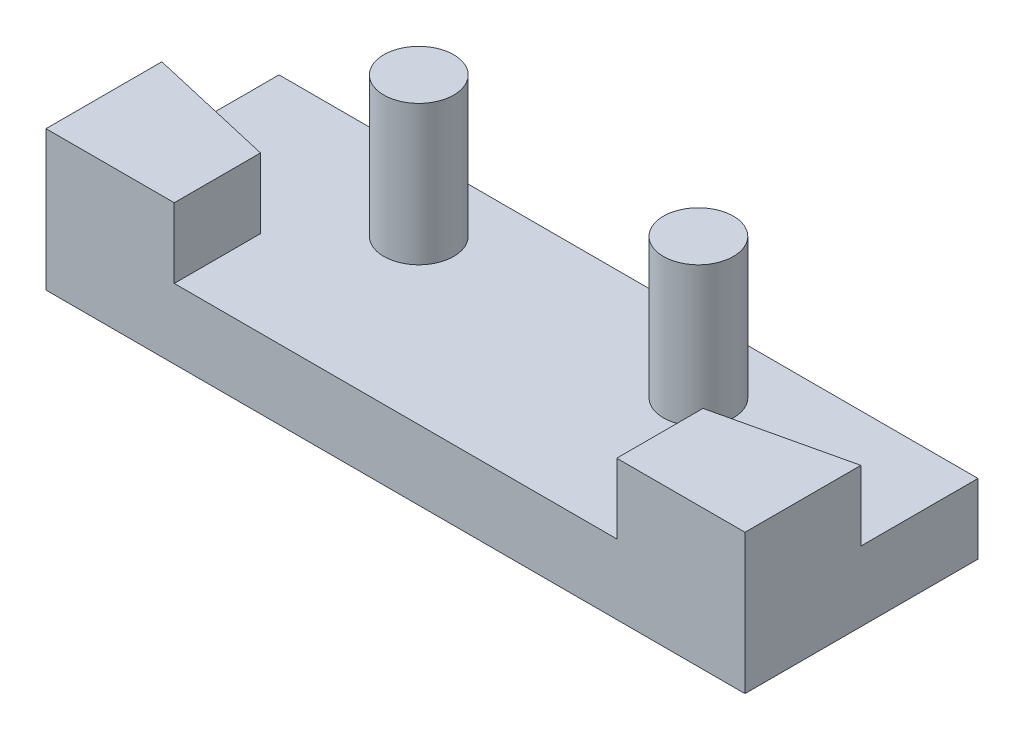
ISO-10303-21;
HEADER;
FILE_DESCRIPTION(('STEP AP214'),'2;1');
FILE_NAME('part.step','',(''),(''),'','','');
FILE_SCHEMA(('AUTOMOTIVE_DESIGN { 1 0 10303 214 1 1 1 1 }'));
ENDSEC;
DATA;
#1=APPLICATION_CONTEXT('core data for automotive mechanical design processes');
#2=APPLICATION_PROTOCOL_DEFINITION('international standard','automotive_design',2000,#1);
#3=PRODUCT_CONTEXT('',#1,'mechanical');
#4=PRODUCT('Part','Part','',(#3));
#5=PRODUCT_RELATED_PRODUCT_CATEGORY('part','',(#4));
#6=PRODUCT_DEFINITION_FORMATION('','',#4);
#7=PRODUCT_DEFINITION_CONTEXT('part definition',#1,'design');
#8=PRODUCT_DEFINITION('design','',#6,#7);
#9=PRODUCT_DEFINITION_SHAPE('','',#8);
#10=(LENGTH_UNIT() NAMED_UNIT(*) SI_UNIT(.MILLI.,.METRE.));
#11=(NAMED_UNIT(*) PLANE_ANGLE_UNIT() SI_UNIT($,.RADIAN.));
#12=(NAMED_UNIT(*) SI_UNIT($,.STERADIAN.) SOLID_ANGLE_UNIT());
#13=UNCERTAINTY_MEASURE_WITH_UNIT(LENGTH_MEASURE(1.E-05),#10,'distance_accuracy_value','');
#14=(GEOMETRIC_REPRESENTATION_CONTEXT(3) GLOBAL_UNCERTAINTY_ASSIGNED_CONTEXT((#13)) GLOBAL_UNIT_ASSIGNED_CONTEXT((#10,
#11,#12)) REPRESENTATION_CONTEXT('',''));
#15=CARTESIAN_POINT('',(0.,0.,0.));
#16=DIRECTION('',(0.,0.,1.));
#17=DIRECTION('',(1.,0.,0.));
#18=AXIS2_PLACEMENT_3D('',#15,#16,#17);
#19=CARTESIAN_POINT('',(0.,6.,10.));
#20=DIRECTION('',(0.,0.,-1.));
#21=DIRECTION('',(-1.,0.,0.));
#22=AXIS2_PLACEMENT_3D('',#19,#20,#21);
#23=PLANE('',#22);
#24=DIRECTION('',(0.,1.,0.));
#25=VECTOR('',#24,1.);
#26=CARTESIAN_POINT('',(24.4957241447966,3.,10.));
#27=LINE('',#26,#25);
#28=CARTESIAN_POINT('',(24.4957241447966,3.,10.));
#29=VERTEX_POINT('',#28);
#30=CARTESIAN_POINT('',(24.4957241447966,6.,10.));
#31=VERTEX_POINT('',#30);
#32=EDGE_CURVE('E200',#29,#31,#27,.T.);
#33=ORIENTED_EDGE('',*,*,#32,.F.);
#34=DIRECTION('',(1.,0.,0.));
#35=VECTOR('',#34,1.);
#36=CARTESIAN_POINT('',(5.50427585520336,3.,10.));
#37=LINE('',#36,#35);
#38=CARTESIAN_POINT('',(5.50427585520336,3.,10.));
#39=VERTEX_POINT('',#38);
#40=EDGE_CURVE('E186',#39,#29,#37,.T.);
#41=ORIENTED_EDGE('',*,*,#40,.F.);
#42=DIRECTION('',(0.,1.,0.));
#43=VECTOR('',#42,1.);
#44=CARTESIAN_POINT('',(5.50427585520336,3.,10.));
#45=LINE('',#44,#43);
#46=CARTESIAN_POINT('',(5.50427585520336,6.,10.));
#47=VERTEX_POINT('',#46);
#48=EDGE_CURVE('E198',#39,#47,#45,.T.);
#49=ORIENTED_EDGE('',*,*,#48,.T.);
#50=DIRECTION('',(1.,0.,0.));
#51=VECTOR('',#50,1.);
#52=CARTESIAN_POINT('',(0.,6.,10.));
#53=LINE('',#52,#51);
#54=CARTESIAN_POINT('',(0.,6.,10.));
#55=VERTEX_POINT('',#54);
#56=EDGE_CURVE('E128',#55,#47,#53,.T.);
#57=ORIENTED_EDGE('',*,*,#56,.F.);
#58=DIRECTION('',(0.,-1.,0.));
#59=VECTOR('',#58,1.);
#60=CARTESIAN_POINT('',(0.,6.,10.));
#61=LINE('',#60,#59);
#62=CARTESIAN_POINT('',(0.,0.,10.));
#63=VERTEX_POINT('',#62);
#64=EDGE_CURVE('E11',#55,#63,#61,.T.);
#65=ORIENTED_EDGE('',*,*,#64,.T.);
#66=DIRECTION('',(1.,0.,0.));
#67=VECTOR('',#66,1.);
#68=CARTESIAN_POINT('',(0.,0.,10.));
#69=LINE('',#68,#67);
#70=CARTESIAN_POINT('',(30.,0.,10.));
#71=VERTEX_POINT('',#70);
#72=EDGE_CURVE('E107',#63,#71,#69,.T.);
#73=ORIENTED_EDGE('',*,*,#72,.T.);
#74=DIRECTION('',(0.,-1.,0.));
#75=VECTOR('',#74,1.);
#76=CARTESIAN_POINT('',(30.,6.,10.));
#77=LINE('',#76,#75);
#78=CARTESIAN_POINT('',(30.,6.,10.));
#79=VERTEX_POINT('',#78);
#80=EDGE_CURVE('E45',#79,#71,#77,.T.);
#81=ORIENTED_EDGE('',*,*,#80,.F.);
#82=EDGE_CURVE('E61',#31,#79,#53,.T.);
#83=ORIENTED_EDGE('',*,*,#82,.F.);
#84=EDGE_LOOP('',(#33,#41,#49,#57,#65,#73,#81,#83));
#85=FACE_BOUND('',#84,.T.);
#86=ADVANCED_FACE('F37',(#85),#23,.F.);
#87=CARTESIAN_POINT('',(30.,6.,0.));
#88=DIRECTION('',(-1.,0.,0.));
#89=DIRECTION('',(0.,0.,1.));
#90=AXIS2_PLACEMENT_3D('',#87,#88,#89);
#91=PLANE('',#90);
#92=DIRECTION('',(0.,1.,0.));
#93=VECTOR('',#92,1.);
#94=CARTESIAN_POINT('',(30.,3.,5.02740271104353));
#95=LINE('',#94,#93);
#96=CARTESIAN_POINT('',(30.,3.,5.02740271104353));
#97=VERTEX_POINT('',#96);
#98=CARTESIAN_POINT('',(30.,6.,5.02740271104353));
#99=VERTEX_POINT('',#98);
#100=EDGE_CURVE('E108',#97,#99,#95,.T.);
#101=ORIENTED_EDGE('',*,*,#100,.T.);
#102=DIRECTION('',(0.,0.,-1.));
#103=VECTOR('',#102,1.);
#104=CARTESIAN_POINT('',(30.,6.,0.));
#105=LINE('',#104,#103);
#106=EDGE_CURVE('E94',#79,#99,#105,.T.);
#107=ORIENTED_EDGE('',*,*,#106,.F.);
#108=ORIENTED_EDGE('',*,*,#80,.T.);
#109=DIRECTION('',(0.,0.,-1.));
#110=VECTOR('',#109,1.);
#111=CARTESIAN_POINT('',(30.,0.,0.));
#112=LINE('',#111,#110);
#113=CARTESIAN_POINT('',(30.,0.,0.));
#114=VERTEX_POINT('',#113);
#115=EDGE_CURVE('E104',#71,#114,#112,.T.);
#116=ORIENTED_EDGE('',*,*,#115,.T.);
#117=DIRECTION('',(0.,-1.,0.));
#118=VECTOR('',#117,1.);
#119=CARTESIAN_POINT('',(30.,6.,0.));
#120=LINE('',#119,#118);
#121=CARTESIAN_POINT('',(30.,3.,0.));
#122=VERTEX_POINT('',#121);
#123=EDGE_CURVE('E93',#122,#114,#120,.T.);
#124=ORIENTED_EDGE('',*,*,#123,.F.);
#125=DIRECTION('',(0.,0.,-1.));
#126=VECTOR('',#125,1.);
#127=CARTESIAN_POINT('',(30.,3.,5.02740271104353));
#128=LINE('',#127,#126);
#129=EDGE_CURVE('E215',#97,#122,#128,.T.);
#130=ORIENTED_EDGE('',*,*,#129,.F.);
#131=EDGE_LOOP('',(#101,#107,#108,#116,#124,#130));
#132=FACE_BOUND('',#131,.T.);
#133=ADVANCED_FACE('F121',(#132),#91,.F.);
#134=CARTESIAN_POINT('',(0.,6.,0.));
#135=DIRECTION('',(0.,1.,0.));
#136=DIRECTION('',(0.,0.,1.));
#137=AXIS2_PLACEMENT_3D('',#134,#135,#136);
#138=PLANE('',#137);
#139=ORIENTED_EDGE('',*,*,#106,.T.);
#140=DIRECTION('',(-0.974370064785236,0.,0.224951054343862));
#141=VECTOR('',#140,1.);
#142=CARTESIAN_POINT('',(30.,6.,5.02740271104353));
#143=LINE('',#142,#141);
#144=CARTESIAN_POINT('',(24.4957241447966,6.,6.29816492119042));
#145=VERTEX_POINT('',#144);
#146=EDGE_CURVE('E139',#99,#145,#143,.T.);
#147=ORIENTED_EDGE('',*,*,#146,.T.);
#148=DIRECTION('',(0.,0.,1.));
#149=VECTOR('',#148,1.);
#150=CARTESIAN_POINT('',(24.4957241447966,6.,6.29816492119042));
#151=LINE('',#150,#149);
#152=EDGE_CURVE('E191',#145,#31,#151,.T.);
#153=ORIENTED_EDGE('',*,*,#152,.T.);
#154=ORIENTED_EDGE('',*,*,#82,.T.);
#155=EDGE_LOOP('',(#139,#147,#153,#154));
#156=FACE_BOUND('',#155,.T.);
#157=ADVANCED_FACE('F136',(#156),#138,.T.);
#158=CARTESIAN_POINT('',(0.,6.,0.));
#159=DIRECTION('',(1.,0.,0.));
#160=DIRECTION('',(0.,0.,-1.));
#161=AXIS2_PLACEMENT_3D('',#158,#159,#160);
#162=PLANE('',#161);
#163=DIRECTION('',(0.,0.,1.));
#164=VECTOR('',#163,1.);
#165=CARTESIAN_POINT('',(0.,6.,0.));
#166=LINE('',#165,#164);
#167=CARTESIAN_POINT('',(0.,6.,5.02740271104353));
#168=VERTEX_POINT('',#167);
#169=EDGE_CURVE('E103',#168,#55,#166,.T.);
#170=ORIENTED_EDGE('',*,*,#169,.F.);
#171=DIRECTION('',(0.,1.,0.));
#172=VECTOR('',#171,1.);
#173=CARTESIAN_POINT('',(0.,3.,5.02740271104353));
#174=LINE('',#173,#172);
#175=CARTESIAN_POINT('',(0.,3.,5.02740271104353));
#176=VERTEX_POINT('',#175);
#177=EDGE_CURVE('E52',#176,#168,#174,.T.);
#178=ORIENTED_EDGE('',*,*,#177,.F.);
#179=DIRECTION('',(0.,0.,-1.));
#180=VECTOR('',#179,1.);
#181=CARTESIAN_POINT('',(0.,3.,5.02740271104353));
#182=LINE('',#181,#180);
#183=CARTESIAN_POINT('',(0.,3.,0.));
#184=VERTEX_POINT('',#183);
#185=EDGE_CURVE('E90',#176,#184,#182,.T.);
#186=ORIENTED_EDGE('',*,*,#185,.T.);
#187=DIRECTION('',(0.,-1.,0.));
#188=VECTOR('',#187,1.);
#189=CARTESIAN_POINT('',(0.,6.,0.));
#190=LINE('',#189,#188);
#191=CARTESIAN_POINT('',(0.,0.,0.));
#192=VERTEX_POINT('',#191);
#193=EDGE_CURVE('E82',#184,#192,#190,.T.);
#194=ORIENTED_EDGE('',*,*,#193,.T.);
#195=DIRECTION('',(0.,0.,1.));
#196=VECTOR('',#195,1.);
#197=CARTESIAN_POINT('',(0.,0.,0.));
#198=LINE('',#197,#196);
#199=EDGE_CURVE('E87',#192,#63,#198,.T.);
#200=ORIENTED_EDGE('',*,*,#199,.T.);
#201=ORIENTED_EDGE('',*,*,#64,.F.);
#202=EDGE_LOOP('',(#170,#178,#186,#194,#200,#201));
#203=FACE_BOUND('',#202,.T.);
#204=ADVANCED_FACE('F39',(#203),#162,.F.);
#205=CARTESIAN_POINT('',(0.,6.,0.));
#206=DIRECTION('',(0.,0.,1.));
#207=DIRECTION('',(1.,0.,0.));
#208=AXIS2_PLACEMENT_3D('',#205,#206,#207);
#209=PLANE('',#208);
#210=ORIENTED_EDGE('',*,*,#193,.F.);
#211=DIRECTION('',(1.,0.,0.));
#212=VECTOR('',#211,1.);
#213=CARTESIAN_POINT('',(0.,3.,0.));
#214=LINE('',#213,#212);
#215=EDGE_CURVE('E162',#184,#122,#214,.T.);
#216=ORIENTED_EDGE('',*,*,#215,.T.);
#217=ORIENTED_EDGE('',*,*,#123,.T.);
#218=DIRECTION('',(-1.,0.,0.));
#219=VECTOR('',#218,1.);
#220=CARTESIAN_POINT('',(0.,0.,0.));
#221=LINE('',#220,#219);
#222=EDGE_CURVE('E97',#114,#192,#221,.T.);
#223=ORIENTED_EDGE('',*,*,#222,.T.);
#224=EDGE_LOOP('',(#210,#216,#217,#223));
#225=FACE_BOUND('',#224,.T.);
#226=ADVANCED_FACE('F98',(#225),#209,.F.);
#227=DIRECTION('',(0.,0.,1.));
#228=VECTOR('',#227,1.);
#229=CARTESIAN_POINT('',(5.50427585520336,6.,6.29816492119042));
#230=LINE('',#229,#228);
#231=CARTESIAN_POINT('',(5.50427585520336,6.,6.29816492119042));
#232=VERTEX_POINT('',#231);
#233=EDGE_CURVE('E194',#232,#47,#230,.T.);
#234=ORIENTED_EDGE('',*,*,#233,.F.);
#235=DIRECTION('',(0.974370064785236,0.,0.224951054343862));
#236=VECTOR('',#235,1.);
#237=CARTESIAN_POINT('',(0.,6.,5.02740271104353));
#238=LINE('',#237,#236);
#239=EDGE_CURVE('E180',#168,#232,#238,.T.);
#240=ORIENTED_EDGE('',*,*,#239,.F.);
#241=ORIENTED_EDGE('',*,*,#169,.T.);
#242=ORIENTED_EDGE('',*,*,#56,.T.);
#243=EDGE_LOOP('',(#234,#240,#241,#242));
#244=FACE_BOUND('',#243,.T.);
#245=ADVANCED_FACE('F253',(#244),#138,.T.);
#246=CARTESIAN_POINT('',(0.,0.,0.));
#247=DIRECTION('',(0.,1.,0.));
#248=DIRECTION('',(0.,0.,1.));
#249=AXIS2_PLACEMENT_3D('',#246,#247,#248);
#250=PLANE('',#249);
#251=ORIENTED_EDGE('',*,*,#199,.F.);
#252=ORIENTED_EDGE('',*,*,#222,.F.);
#253=ORIENTED_EDGE('',*,*,#115,.F.);
#254=ORIENTED_EDGE('',*,*,#72,.F.);
#255=EDGE_LOOP('',(#251,#252,#253,#254));
#256=FACE_BOUND('',#255,.T.);
#257=ADVANCED_FACE('F106',(#256),#250,.F.);
#258=CARTESIAN_POINT('',(30.,3.,5.02740271104353));
#259=DIRECTION('',(-0.224951054343862,0.,-0.974370064785236));
#260=DIRECTION('',(-0.974370064785236,0.,0.224951054343862));
#261=AXIS2_PLACEMENT_3D('',#258,#259,#260);
#262=PLANE('',#261);
#263=ORIENTED_EDGE('',*,*,#146,.F.);
#264=ORIENTED_EDGE('',*,*,#100,.F.);
#265=DIRECTION('',(-0.974370064785236,0.,0.224951054343862));
#266=VECTOR('',#265,1.);
#267=CARTESIAN_POINT('',(30.,3.,5.02740271104353));
#268=LINE('',#267,#266);
#269=CARTESIAN_POINT('',(24.4957241447966,3.,6.29816492119042));
#270=VERTEX_POINT('',#269);
#271=EDGE_CURVE('E205',#97,#270,#268,.T.);
#272=ORIENTED_EDGE('',*,*,#271,.T.);
#273=DIRECTION('',(0.,1.,0.));
#274=VECTOR('',#273,1.);
#275=CARTESIAN_POINT('',(24.4957241447966,3.,6.29816492119042));
#276=LINE('',#275,#274);
#277=EDGE_CURVE('E112',#270,#145,#276,.T.);
#278=ORIENTED_EDGE('',*,*,#277,.T.);
#279=EDGE_LOOP('',(#263,#264,#272,#278));
#280=FACE_BOUND('',#279,.T.);
#281=ADVANCED_FACE('F203',(#280),#262,.T.);
#282=CARTESIAN_POINT('',(24.4957241447966,3.,6.29816492119042));
#283=DIRECTION('',(-1.,0.,0.));
#284=DIRECTION('',(0.,0.,1.));
#285=AXIS2_PLACEMENT_3D('',#282,#283,#284);
#286=PLANE('',#285);
#287=ORIENTED_EDGE('',*,*,#152,.F.);
#288=ORIENTED_EDGE('',*,*,#277,.F.);
#289=DIRECTION('',(0.,0.,1.));
#290=VECTOR('',#289,1.);
#291=CARTESIAN_POINT('',(24.4957241447966,3.,6.29816492119042));
#292=LINE('',#291,#290);
#293=EDGE_CURVE('E209',#270,#29,#292,.T.);
#294=ORIENTED_EDGE('',*,*,#293,.T.);
#295=ORIENTED_EDGE('',*,*,#32,.T.);
#296=EDGE_LOOP('',(#287,#288,#294,#295));
#297=FACE_BOUND('',#296,.T.);
#298=ADVANCED_FACE('F208',(#297),#286,.T.);
#299=CARTESIAN_POINT('',(5.50427585520336,3.,6.29816492119042));
#300=DIRECTION('',(-1.,0.,0.));
#301=DIRECTION('',(0.,0.,1.));
#302=AXIS2_PLACEMENT_3D('',#299,#300,#301);
#303=PLANE('',#302);
#304=ORIENTED_EDGE('',*,*,#233,.T.);
#305=ORIENTED_EDGE('',*,*,#48,.F.);
#306=DIRECTION('',(0.,0.,1.));
#307=VECTOR('',#306,1.);
#308=CARTESIAN_POINT('',(5.50427585520336,3.,6.29816492119042));
#309=LINE('',#308,#307);
#310=CARTESIAN_POINT('',(5.50427585520336,3.,6.29816492119042));
#311=VERTEX_POINT('',#310);
#312=EDGE_CURVE('E183',#311,#39,#309,.T.);
#313=ORIENTED_EDGE('',*,*,#312,.F.);
#314=DIRECTION('',(0.,1.,0.));
#315=VECTOR('',#314,1.);
#316=CARTESIAN_POINT('',(5.50427585520336,3.,6.29816492119042));
#317=LINE('',#316,#315);
#318=EDGE_CURVE('E156',#311,#232,#317,.T.);
#319=ORIENTED_EDGE('',*,*,#318,.T.);
#320=EDGE_LOOP('',(#304,#305,#313,#319));
#321=FACE_BOUND('',#320,.T.);
#322=ADVANCED_FACE('F262',(#321),#303,.F.);
#323=CARTESIAN_POINT('',(0.,3.,5.02740271104353));
#324=DIRECTION('',(-0.224951054343862,0.,0.974370064785236));
#325=DIRECTION('',(0.974370064785236,0.,0.224951054343862));
#326=AXIS2_PLACEMENT_3D('',#323,#324,#325);
#327=PLANE('',#326);
#328=ORIENTED_EDGE('',*,*,#239,.T.);
#329=ORIENTED_EDGE('',*,*,#318,.F.);
#330=DIRECTION('',(0.974370064785236,0.,0.224951054343862));
#331=VECTOR('',#330,1.);
#332=CARTESIAN_POINT('',(0.,3.,5.02740271104353));
#333=LINE('',#332,#331);
#334=EDGE_CURVE('E179',#176,#311,#333,.T.);
#335=ORIENTED_EDGE('',*,*,#334,.F.);
#336=ORIENTED_EDGE('',*,*,#177,.T.);
#337=EDGE_LOOP('',(#328,#329,#335,#336));
#338=FACE_BOUND('',#337,.T.);
#339=ADVANCED_FACE('F182',(#338),#327,.F.);
#340=CARTESIAN_POINT('',(0.,3.,0.));
#341=DIRECTION('',(0.,-1.,0.));
#342=DIRECTION('',(0.,0.,-1.));
#343=AXIS2_PLACEMENT_3D('',#340,#341,#342);
#344=PLANE('',#343);
#345=CARTESIAN_POINT('',(21.,3.,3.));
#346=DIRECTION('',(0.,1.,0.));
#347=DIRECTION('',(0.,0.,1.));
#348=AXIS2_PLACEMENT_3D('',#345,#346,#347);
#349=CIRCLE('',#348,1.5);
#350=CARTESIAN_POINT('',(21.,3.,4.5));
#351=VERTEX_POINT('',#350);
#352=EDGE_CURVE('E223',#351,#351,#349,.T.);
#353=ORIENTED_EDGE('',*,*,#352,.F.);
#354=EDGE_LOOP('',(#353));
#355=FACE_BOUND('',#354,.T.);
#356=CARTESIAN_POINT('',(9.,3.,3.));
#357=DIRECTION('',(0.,1.,0.));
#358=DIRECTION('',(0.,0.,1.));
#359=AXIS2_PLACEMENT_3D('',#356,#357,#358);
#360=CIRCLE('',#359,1.5);
#361=CARTESIAN_POINT('',(9.,3.,4.50000000000001));
#362=VERTEX_POINT('',#361);
#363=EDGE_CURVE('E192',#362,#362,#360,.T.);
#364=ORIENTED_EDGE('',*,*,#363,.F.);
#365=EDGE_LOOP('',(#364));
#366=FACE_BOUND('',#365,.T.);
#367=ORIENTED_EDGE('',*,*,#185,.F.);
#368=ORIENTED_EDGE('',*,*,#334,.T.);
#369=ORIENTED_EDGE('',*,*,#312,.T.);
#370=ORIENTED_EDGE('',*,*,#40,.T.);
#371=ORIENTED_EDGE('',*,*,#293,.F.);
#372=ORIENTED_EDGE('',*,*,#271,.F.);
#373=ORIENTED_EDGE('',*,*,#129,.T.);
#374=ORIENTED_EDGE('',*,*,#215,.F.);
#375=EDGE_LOOP('',(#367,#368,#369,#370,#371,#372,#373,#374));
#376=FACE_BOUND('',#375,.T.);
#377=ADVANCED_FACE('F177',(#355,#366,#376),#344,.F.);
#378=CARTESIAN_POINT('',(9.,3.,3.));
#379=DIRECTION('',(0.,1.,0.));
#380=DIRECTION('',(0.,0.,1.));
#381=AXIS2_PLACEMENT_3D('',#378,#379,#380);
#382=CYLINDRICAL_SURFACE('',#381,1.5);
#383=ORIENTED_EDGE('',*,*,#363,.T.);
#384=EDGE_LOOP('',(#383));
#385=FACE_BOUND('',#384,.T.);
#386=CARTESIAN_POINT('',(9.,9.,3.));
#387=DIRECTION('',(0.,1.,0.));
#388=DIRECTION('',(0.,0.,1.));
#389=AXIS2_PLACEMENT_3D('',#386,#387,#388);
#390=CIRCLE('',#389,1.5);
#391=CARTESIAN_POINT('',(9.,9.,4.50000000000001));
#392=VERTEX_POINT('',#391);
#393=EDGE_CURVE('E220',#392,#392,#390,.T.);
#394=ORIENTED_EDGE('',*,*,#393,.F.);
#395=EDGE_LOOP('',(#394));
#396=FACE_BOUND('',#395,.T.);
#397=ADVANCED_FACE('F242',(#385,#396),#382,.T.);
#398=CARTESIAN_POINT('',(0.,9.,0.));
#399=DIRECTION('',(0.,1.,0.));
#400=DIRECTION('',(0.,0.,1.));
#401=AXIS2_PLACEMENT_3D('',#398,#399,#400);
#402=PLANE('',#401);
#403=ORIENTED_EDGE('',*,*,#393,.T.);
#404=EDGE_LOOP('',(#403));
#405=FACE_BOUND('',#404,.T.);
#406=ADVANCED_FACE('F234',(#405),#402,.T.);
#407=CARTESIAN_POINT('',(21.,3.,3.));
#408=DIRECTION('',(0.,1.,0.));
#409=DIRECTION('',(0.,0.,1.));
#410=AXIS2_PLACEMENT_3D('',#407,#408,#409);
#411=CYLINDRICAL_SURFACE('',#410,1.5);
#412=ORIENTED_EDGE('',*,*,#352,.T.);
#413=EDGE_LOOP('',(#412));
#414=FACE_BOUND('',#413,.T.);
#415=CARTESIAN_POINT('',(21.,9.,3.));
#416=DIRECTION('',(0.,1.,0.));
#417=DIRECTION('',(0.,0.,1.));
#418=AXIS2_PLACEMENT_3D('',#415,#416,#417);
#419=CIRCLE('',#418,1.5);
#420=CARTESIAN_POINT('',(21.,9.,4.5));
#421=VERTEX_POINT('',#420);
#422=EDGE_CURVE('E226',#421,#421,#419,.T.);
#423=ORIENTED_EDGE('',*,*,#422,.F.);
#424=EDGE_LOOP('',(#423));
#425=FACE_BOUND('',#424,.T.);
#426=ADVANCED_FACE('F232',(#414,#425),#411,.T.);
#427=CARTESIAN_POINT('',(0.,9.,0.));
#428=DIRECTION('',(0.,1.,0.));
#429=DIRECTION('',(0.,0.,1.));
#430=AXIS2_PLACEMENT_3D('',#427,#428,#429);
#431=PLANE('',#430);
#432=ORIENTED_EDGE('',*,*,#422,.T.);
#433=EDGE_LOOP('',(#432));
#434=FACE_BOUND('',#433,.T.);
#435=ADVANCED_FACE('F230',(#434),#431,.T.);
#436=CLOSED_SHELL('',(#86,#133,#157,#204,#226,#245,#257,#281,#298,#322,#339,#377,#397,#406,#426,#435));
#437=MANIFOLD_SOLID_BREP('B2',#436);
#438=ADVANCED_BREP_SHAPE_REPRESENTATION('',(#18,#437),#14);
#439=SHAPE_DEFINITION_REPRESENTATION(#9,#438);
ENDSEC;
END-ISO-10303-21;
